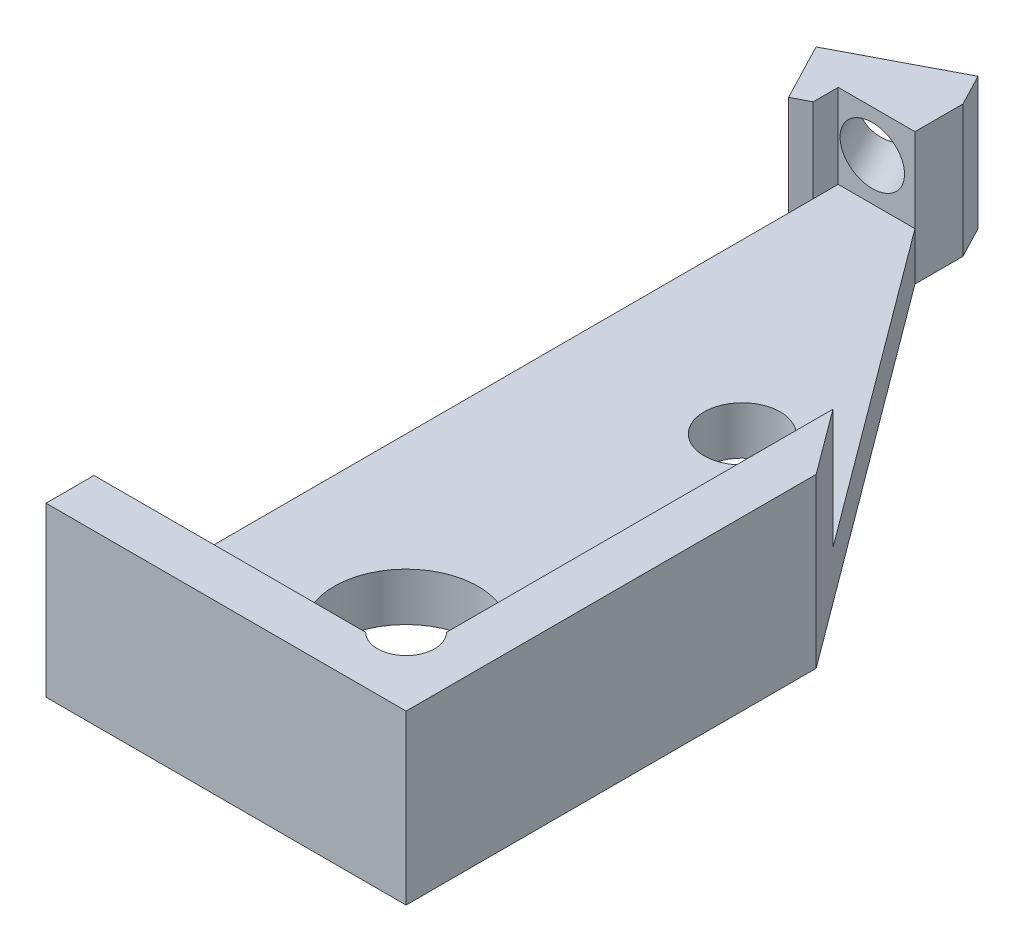
ISO-10303-21;
HEADER;
FILE_DESCRIPTION(('STEP AP214'),'2;1');
FILE_NAME('part.step','',(''),(''),'','','');
FILE_SCHEMA(('AUTOMOTIVE_DESIGN { 1 0 10303 214 1 1 1 1 }'));
ENDSEC;
DATA;
#1=APPLICATION_CONTEXT('core data for automotive mechanical design processes');
#2=APPLICATION_PROTOCOL_DEFINITION('international standard','automotive_design',2000,#1);
#3=PRODUCT_CONTEXT('',#1,'mechanical');
#4=PRODUCT('Part','Part','',(#3));
#5=PRODUCT_RELATED_PRODUCT_CATEGORY('part','',(#4));
#6=PRODUCT_DEFINITION_FORMATION('','',#4);
#7=PRODUCT_DEFINITION_CONTEXT('part definition',#1,'design');
#8=PRODUCT_DEFINITION('design','',#6,#7);
#9=PRODUCT_DEFINITION_SHAPE('','',#8);
#10=(LENGTH_UNIT() NAMED_UNIT(*) SI_UNIT(.MILLI.,.METRE.));
#11=(NAMED_UNIT(*) PLANE_ANGLE_UNIT() SI_UNIT($,.RADIAN.));
#12=(NAMED_UNIT(*) SI_UNIT($,.STERADIAN.) SOLID_ANGLE_UNIT());
#13=UNCERTAINTY_MEASURE_WITH_UNIT(LENGTH_MEASURE(1.E-05),#10,'distance_accuracy_value','');
#14=(GEOMETRIC_REPRESENTATION_CONTEXT(3) GLOBAL_UNCERTAINTY_ASSIGNED_CONTEXT((#13)) GLOBAL_UNIT_ASSIGNED_CONTEXT((#10,
#11,#12)) REPRESENTATION_CONTEXT('',''));
#15=CARTESIAN_POINT('',(0.,0.,0.));
#16=DIRECTION('',(0.,0.,1.));
#17=DIRECTION('',(1.,0.,0.));
#18=AXIS2_PLACEMENT_3D('',#15,#16,#17);
#19=CARTESIAN_POINT('',(0.,3.5,0.));
#20=DIRECTION('',(0.,-1.,0.));
#21=DIRECTION('',(0.,0.,-1.));
#22=AXIS2_PLACEMENT_3D('',#19,#20,#21);
#23=PLANE('',#22);
#24=DIRECTION('',(1.,0.,0.));
#25=VECTOR('',#24,1.);
#26=CARTESIAN_POINT('',(2.75,3.5,7.75));
#27=LINE('',#26,#25);
#28=CARTESIAN_POINT('',(-3.75,3.5,7.75));
#29=VERTEX_POINT('',#28);
#30=CARTESIAN_POINT('',(1.90810098864976,3.5,7.75));
#31=VERTEX_POINT('',#30);
#32=EDGE_CURVE('E256',#29,#31,#27,.T.);
#33=ORIENTED_EDGE('',*,*,#32,.F.);
#34=DIRECTION('',(0.,0.,1.));
#35=VECTOR('',#34,1.);
#36=CARTESIAN_POINT('',(-3.75,3.5,-8.75));
#37=LINE('',#36,#35);
#38=CARTESIAN_POINT('',(-3.75,3.5,8.75));
#39=VERTEX_POINT('',#38);
#40=EDGE_CURVE('E268',#29,#39,#37,.T.);
#41=ORIENTED_EDGE('',*,*,#40,.T.);
#42=DIRECTION('',(1.,0.,0.));
#43=VECTOR('',#42,1.);
#44=CARTESIAN_POINT('',(3.75,3.5,8.75));
#45=LINE('',#44,#43);
#46=CARTESIAN_POINT('',(3.75,3.5,8.75));
#47=VERTEX_POINT('',#46);
#48=EDGE_CURVE('E270',#39,#47,#45,.T.);
#49=ORIENTED_EDGE('',*,*,#48,.T.);
#50=DIRECTION('',(0.,0.,-1.));
#51=VECTOR('',#50,1.);
#52=CARTESIAN_POINT('',(3.75,3.5,-8.75));
#53=LINE('',#52,#51);
#54=CARTESIAN_POINT('',(3.75,3.5,0.208562074203243));
#55=VERTEX_POINT('',#54);
#56=EDGE_CURVE('E273',#47,#55,#53,.T.);
#57=ORIENTED_EDGE('',*,*,#56,.T.);
#58=DIRECTION('',(0.595668713356042,0.,0.803230218510707));
#59=VECTOR('',#58,1.);
#60=CARTESIAN_POINT('',(2.31963201516526,3.5,-1.72021941666348));
#61=LINE('',#60,#59);
#62=CARTESIAN_POINT('',(2.75,3.5,-1.13988917143168));
#63=VERTEX_POINT('',#62);
#64=EDGE_CURVE('E190',#63,#55,#61,.T.);
#65=ORIENTED_EDGE('',*,*,#64,.F.);
#66=DIRECTION('',(0.,0.,-1.));
#67=VECTOR('',#66,1.);
#68=CARTESIAN_POINT('',(2.75,3.5,-7.75));
#69=LINE('',#68,#67);
#70=CARTESIAN_POINT('',(2.75,3.5,6.90810098864977));
#71=VERTEX_POINT('',#70);
#72=EDGE_CURVE('E259',#71,#63,#69,.T.);
#73=ORIENTED_EDGE('',*,*,#72,.F.);
#74=CARTESIAN_POINT('',(2.32905049432488,3.5,7.32905049432488));
#75=DIRECTION('',(0.,1.,0.));
#76=DIRECTION('',(0.,0.,1.));
#77=AXIS2_PLACEMENT_3D('',#74,#75,#76);
#78=CIRCLE('',#77,0.595312500000001);
#79=EDGE_CURVE('E58',#31,#71,#78,.T.);
#80=ORIENTED_EDGE('',*,*,#79,.F.);
#81=EDGE_LOOP('',(#33,#41,#49,#57,#65,#73,#80));
#82=FACE_BOUND('',#81,.T.);
#83=ADVANCED_FACE('F35',(#82),#23,.F.);
#84=CARTESIAN_POINT('',(0.,2.75,0.));
#85=DIRECTION('',(0.,-1.,0.));
#86=DIRECTION('',(0.,0.,-1.));
#87=AXIS2_PLACEMENT_3D('',#84,#85,#86);
#88=PLANE('',#87);
#89=DIRECTION('',(0.,0.,1.));
#90=VECTOR('',#89,1.);
#91=CARTESIAN_POINT('',(-3.75,2.75,0.));
#92=LINE('',#91,#90);
#93=CARTESIAN_POINT('',(-3.75,2.75,-7.75));
#94=VERTEX_POINT('',#93);
#95=CARTESIAN_POINT('',(-3.75,2.75,-7.22820528636593));
#96=VERTEX_POINT('',#95);
#97=EDGE_CURVE('E164',#94,#96,#92,.T.);
#98=ORIENTED_EDGE('',*,*,#97,.F.);
#99=DIRECTION('',(-1.,0.,0.));
#100=VECTOR('',#99,1.);
#101=CARTESIAN_POINT('',(2.75,2.75,-7.75));
#102=LINE('',#101,#100);
#103=CARTESIAN_POINT('',(-2.15200209311677,2.75,-7.75));
#104=VERTEX_POINT('',#103);
#105=EDGE_CURVE('E161',#104,#94,#102,.T.);
#106=ORIENTED_EDGE('',*,*,#105,.F.);
#107=DIRECTION('',(0.,0.,1.));
#108=VECTOR('',#107,1.);
#109=CARTESIAN_POINT('',(-2.15200209311678,2.75,0.));
#110=LINE('',#109,#108);
#111=CARTESIAN_POINT('',(-2.15200209311677,2.75,-8.75));
#112=VERTEX_POINT('',#111);
#113=EDGE_CURVE('E12',#112,#104,#110,.T.);
#114=ORIENTED_EDGE('',*,*,#113,.F.);
#115=DIRECTION('',(-0.462604740450131,0.,-0.886564636173284));
#116=VECTOR('',#115,1.);
#117=CARTESIAN_POINT('',(-2.49397867231052,2.75,-9.40538528900002));
#118=LINE('',#117,#116);
#119=CARTESIAN_POINT('',(-2.49397867231052,2.75,-9.40538528900002));
#120=VERTEX_POINT('',#119);
#121=EDGE_CURVE('E202',#112,#120,#118,.T.);
#122=ORIENTED_EDGE('',*,*,#121,.T.);
#123=DIRECTION('',(-0.886564636173283,0.,0.462604740450132));
#124=VECTOR('',#123,1.);
#125=CARTESIAN_POINT('',(-2.49397867231052,2.75,-9.40538528900002));
#126=LINE('',#125,#124);
#127=CARTESIAN_POINT('',(-4.71039026274373,2.75,-8.24887343787469));
#128=VERTEX_POINT('',#127);
#129=EDGE_CURVE('E50',#120,#128,#126,.T.);
#130=ORIENTED_EDGE('',*,*,#129,.T.);
#131=DIRECTION('',(0.462604740450133,0.,0.886564636173283));
#132=VECTOR('',#131,1.);
#133=CARTESIAN_POINT('',(-4.08625811344759,2.75,-7.05274758035242));
#134=LINE('',#133,#132);
#135=CARTESIAN_POINT('',(-4.08625811344759,2.75,-7.05274758035242));
#136=VERTEX_POINT('',#135);
#137=EDGE_CURVE('E43',#128,#136,#134,.T.);
#138=ORIENTED_EDGE('',*,*,#137,.T.);
#139=DIRECTION('',(0.886564636173283,0.,-0.462604740450133));
#140=VECTOR('',#139,1.);
#141=CARTESIAN_POINT('',(-1.86984652301438,2.75,-8.20925943147775));
#142=LINE('',#141,#140);
#143=EDGE_CURVE('E198',#136,#96,#142,.T.);
#144=ORIENTED_EDGE('',*,*,#143,.T.);
#145=EDGE_LOOP('',(#98,#106,#114,#122,#130,#138,#144));
#146=FACE_BOUND('',#145,.T.);
#147=ADVANCED_FACE('F289',(#146),#88,.F.);
#148=CARTESIAN_POINT('',(-3.75,3.5,-8.75));
#149=DIRECTION('',(1.,0.,0.));
#150=DIRECTION('',(0.,0.,-1.));
#151=AXIS2_PLACEMENT_3D('',#148,#149,#150);
#152=PLANE('',#151);
#153=DIRECTION('',(0.,-1.,0.));
#154=VECTOR('',#153,1.);
#155=CARTESIAN_POINT('',(-3.75,4.,7.75));
#156=LINE('',#155,#154);
#157=CARTESIAN_POINT('',(-3.75,1.,7.75));
#158=VERTEX_POINT('',#157);
#159=EDGE_CURVE('E165',#29,#158,#156,.T.);
#160=ORIENTED_EDGE('',*,*,#159,.T.);
#161=DIRECTION('',(0.,0.,1.));
#162=VECTOR('',#161,1.);
#163=CARTESIAN_POINT('',(-3.75,1.,7.75));
#164=LINE('',#163,#162);
#165=CARTESIAN_POINT('',(-3.75,1.,-7.22820528636593));
#166=VERTEX_POINT('',#165);
#167=EDGE_CURVE('E170',#166,#158,#164,.T.);
#168=ORIENTED_EDGE('',*,*,#167,.F.);
#169=DIRECTION('',(0.,-1.,0.));
#170=VECTOR('',#169,1.);
#171=CARTESIAN_POINT('',(-3.75,3.5,-7.22820528636593));
#172=LINE('',#171,#170);
#173=CARTESIAN_POINT('',(-3.75,0.,-7.22820528636593));
#174=VERTEX_POINT('',#173);
#175=EDGE_CURVE('E224',#166,#174,#172,.T.);
#176=ORIENTED_EDGE('',*,*,#175,.T.);
#177=DIRECTION('',(0.,0.,1.));
#178=VECTOR('',#177,1.);
#179=CARTESIAN_POINT('',(-3.75,0.,-8.75));
#180=LINE('',#179,#178);
#181=CARTESIAN_POINT('',(-3.75,0.,8.75));
#182=VERTEX_POINT('',#181);
#183=EDGE_CURVE('E154',#174,#182,#180,.T.);
#184=ORIENTED_EDGE('',*,*,#183,.T.);
#185=DIRECTION('',(0.,-1.,0.));
#186=VECTOR('',#185,1.);
#187=CARTESIAN_POINT('',(-3.75,3.5,8.75));
#188=LINE('',#187,#186);
#189=EDGE_CURVE('E284',#39,#182,#188,.T.);
#190=ORIENTED_EDGE('',*,*,#189,.F.);
#191=ORIENTED_EDGE('',*,*,#40,.F.);
#192=EDGE_LOOP('',(#160,#168,#176,#184,#190,#191));
#193=FACE_BOUND('',#192,.T.);
#194=ADVANCED_FACE('F37',(#193),#152,.F.);
#195=CARTESIAN_POINT('',(-3.60218446752712,1.875,-8.82712936343735));
#196=DIRECTION('',(-0.462604740450132,0.,-0.886564636173283));
#197=DIRECTION('',(-0.886564636173283,0.,0.462604740450132));
#198=AXIS2_PLACEMENT_3D('',#195,#196,#197);
#199=CYLINDRICAL_SURFACE('',#198,0.595629999999999);
#200=CARTESIAN_POINT('',(-3.60218446752712,1.875,-8.82712936343735));
#201=DIRECTION('',(-0.462604740450132,0.,-0.886564636173283));
#202=DIRECTION('',(-0.886564636173283,0.,0.462604740450132));
#203=AXIS2_PLACEMENT_3D('',#200,#201,#202);
#204=CIRCLE('',#203,0.595629999999999);
#205=CARTESIAN_POINT('',(-4.13024896177101,1.875,-8.55158810188304));
#206=VERTEX_POINT('',#205);
#207=EDGE_CURVE('E192',#206,#206,#204,.T.);
#208=ORIENTED_EDGE('',*,*,#207,.T.);
#209=EDGE_LOOP('',(#208));
#210=FACE_BOUND('',#209,.T.);
#211=CARTESIAN_POINT('',(-3.04014405978548,1.875,-7.75));
#212=DIRECTION('',(0.,0.,-1.));
#213=DIRECTION('',(-1.,0.,0.));
#214=AXIS2_PLACEMENT_3D('',#211,#212,#213);
#215=ELLIPSE('',#214,0.671840467910994,0.595629999999999);
#216=CARTESIAN_POINT('',(-3.71198452769648,1.875,-7.75));
#217=VERTEX_POINT('',#216);
#218=EDGE_CURVE('E195',#217,#217,#215,.T.);
#219=ORIENTED_EDGE('',*,*,#218,.F.);
#220=EDGE_LOOP('',(#219));
#221=FACE_BOUND('',#220,.T.);
#222=ADVANCED_FACE('F361',(#210,#221),#199,.F.);
#223=CARTESIAN_POINT('',(3.75,3.5,-8.75));
#224=DIRECTION('',(-1.,0.,0.));
#225=DIRECTION('',(0.,0.,1.));
#226=AXIS2_PLACEMENT_3D('',#223,#224,#225);
#227=PLANE('',#226);
#228=DIRECTION('',(0.,-1.,0.));
#229=VECTOR('',#228,1.);
#230=CARTESIAN_POINT('',(3.75,5.,0.208562074203243));
#231=LINE('',#230,#229);
#232=CARTESIAN_POINT('',(3.75,0.,0.208562074203243));
#233=VERTEX_POINT('',#232);
#234=EDGE_CURVE('E185',#55,#233,#231,.T.);
#235=ORIENTED_EDGE('',*,*,#234,.F.);
#236=ORIENTED_EDGE('',*,*,#56,.F.);
#237=DIRECTION('',(0.,-1.,0.));
#238=VECTOR('',#237,1.);
#239=CARTESIAN_POINT('',(3.75,3.5,8.75));
#240=LINE('',#239,#238);
#241=CARTESIAN_POINT('',(3.75,0.,8.75));
#242=VERTEX_POINT('',#241);
#243=EDGE_CURVE('E276',#47,#242,#240,.T.);
#244=ORIENTED_EDGE('',*,*,#243,.T.);
#245=DIRECTION('',(0.,0.,-1.));
#246=VECTOR('',#245,1.);
#247=CARTESIAN_POINT('',(3.75,0.,-8.75));
#248=LINE('',#247,#246);
#249=EDGE_CURVE('E271',#242,#233,#248,.T.);
#250=ORIENTED_EDGE('',*,*,#249,.T.);
#251=EDGE_LOOP('',(#235,#236,#244,#250));
#252=FACE_BOUND('',#251,.T.);
#253=ADVANCED_FACE('F358',(#252),#227,.F.);
#254=CARTESIAN_POINT('',(0.,0.,0.));
#255=DIRECTION('',(0.,-1.,0.));
#256=DIRECTION('',(0.,0.,-1.));
#257=AXIS2_PLACEMENT_3D('',#254,#255,#256);
#258=PLANE('',#257);
#259=CARTESIAN_POINT('',(1.625,0.,6.5));
#260=DIRECTION('',(0.,1.,0.));
#261=DIRECTION('',(0.,0.,1.));
#262=AXIS2_PLACEMENT_3D('',#259,#260,#261);
#263=CIRCLE('',#262,0.79375);
#264=CARTESIAN_POINT('',(1.625,0.,7.29375));
#265=VERTEX_POINT('',#264);
#266=EDGE_CURVE('E229',#265,#265,#263,.T.);
#267=ORIENTED_EDGE('',*,*,#266,.T.);
#268=EDGE_LOOP('',(#267));
#269=FACE_BOUND('',#268,.T.);
#270=CARTESIAN_POINT('',(-2.125,0.,6.5));
#271=DIRECTION('',(0.,1.,0.));
#272=DIRECTION('',(0.,0.,1.));
#273=AXIS2_PLACEMENT_3D('',#270,#271,#272);
#274=CIRCLE('',#273,0.793750000000001);
#275=CARTESIAN_POINT('',(-2.125,0.,7.29375));
#276=VERTEX_POINT('',#275);
#277=EDGE_CURVE('E235',#276,#276,#274,.T.);
#278=ORIENTED_EDGE('',*,*,#277,.T.);
#279=EDGE_LOOP('',(#278));
#280=FACE_BOUND('',#279,.T.);
#281=CARTESIAN_POINT('',(-0.250000000000001,0.,-2.25));
#282=DIRECTION('',(0.,1.,0.));
#283=DIRECTION('',(0.,0.,1.));
#284=AXIS2_PLACEMENT_3D('',#281,#282,#283);
#285=CIRCLE('',#284,0.79375);
#286=CARTESIAN_POINT('',(-0.250000000000001,0.,-1.45625));
#287=VERTEX_POINT('',#286);
#288=EDGE_CURVE('E241',#287,#287,#285,.T.);
#289=ORIENTED_EDGE('',*,*,#288,.T.);
#290=EDGE_LOOP('',(#289));
#291=FACE_BOUND('',#290,.T.);
#292=CARTESIAN_POINT('',(-0.25,0.,4.75));
#293=DIRECTION('',(0.,1.,0.));
#294=DIRECTION('',(0.,0.,1.));
#295=AXIS2_PLACEMENT_3D('',#292,#293,#294);
#296=CIRCLE('',#295,1.5);
#297=CARTESIAN_POINT('',(-0.25,0.,6.25));
#298=VERTEX_POINT('',#297);
#299=EDGE_CURVE('E253',#298,#298,#296,.T.);
#300=ORIENTED_EDGE('',*,*,#299,.T.);
#301=EDGE_LOOP('',(#300));
#302=FACE_BOUND('',#301,.T.);
#303=DIRECTION('',(0.,0.,1.));
#304=VECTOR('',#303,1.);
#305=CARTESIAN_POINT('',(-2.15200209311677,0.,-9.31323554731023));
#306=LINE('',#305,#304);
#307=CARTESIAN_POINT('',(-2.15200209311677,0.,-8.75));
#308=VERTEX_POINT('',#307);
#309=CARTESIAN_POINT('',(-2.15200209311677,0.,-7.75));
#310=VERTEX_POINT('',#309);
#311=EDGE_CURVE('E179',#308,#310,#306,.T.);
#312=ORIENTED_EDGE('',*,*,#311,.T.);
#313=DIRECTION('',(0.595668713356042,0.,0.803230218510707));
#314=VECTOR('',#313,1.);
#315=CARTESIAN_POINT('',(-2.15200209311677,0.,-7.75));
#316=LINE('',#315,#314);
#317=EDGE_CURVE('E176',#310,#233,#316,.T.);
#318=ORIENTED_EDGE('',*,*,#317,.T.);
#319=ORIENTED_EDGE('',*,*,#249,.F.);
#320=DIRECTION('',(1.,0.,0.));
#321=VECTOR('',#320,1.);
#322=CARTESIAN_POINT('',(3.75,0.,8.75));
#323=LINE('',#322,#321);
#324=EDGE_CURVE('E278',#182,#242,#323,.T.);
#325=ORIENTED_EDGE('',*,*,#324,.F.);
#326=ORIENTED_EDGE('',*,*,#183,.F.);
#327=DIRECTION('',(0.886564636173283,0.,-0.462604740450133));
#328=VECTOR('',#327,1.);
#329=CARTESIAN_POINT('',(-1.86984652301438,0.,-8.20925943147775));
#330=LINE('',#329,#328);
#331=CARTESIAN_POINT('',(-4.08625811344759,0.,-7.05274758035242));
#332=VERTEX_POINT('',#331);
#333=EDGE_CURVE('E211',#332,#174,#330,.T.);
#334=ORIENTED_EDGE('',*,*,#333,.F.);
#335=DIRECTION('',(0.462604740450133,0.,0.886564636173283));
#336=VECTOR('',#335,1.);
#337=CARTESIAN_POINT('',(-4.08625811344759,0.,-7.05274758035242));
#338=LINE('',#337,#336);
#339=CARTESIAN_POINT('',(-4.71039026274373,0.,-8.24887343787469));
#340=VERTEX_POINT('',#339);
#341=EDGE_CURVE('E215',#340,#332,#338,.T.);
#342=ORIENTED_EDGE('',*,*,#341,.F.);
#343=DIRECTION('',(-0.886564636173283,0.,0.462604740450132));
#344=VECTOR('',#343,1.);
#345=CARTESIAN_POINT('',(-2.49397867231052,0.,-9.40538528900002));
#346=LINE('',#345,#344);
#347=CARTESIAN_POINT('',(-2.49397867231052,0.,-9.40538528900002));
#348=VERTEX_POINT('',#347);
#349=EDGE_CURVE('E205',#348,#340,#346,.T.);
#350=ORIENTED_EDGE('',*,*,#349,.F.);
#351=DIRECTION('',(-0.462604740450131,0.,-0.886564636173284));
#352=VECTOR('',#351,1.);
#353=CARTESIAN_POINT('',(-2.49397867231052,0.,-9.40538528900002));
#354=LINE('',#353,#352);
#355=EDGE_CURVE('E208',#308,#348,#354,.T.);
#356=ORIENTED_EDGE('',*,*,#355,.F.);
#357=EDGE_LOOP('',(#312,#318,#319,#325,#326,#334,#342,#350,#356));
#358=FACE_BOUND('',#357,.T.);
#359=ADVANCED_FACE('F300',(#269,#280,#291,#302,#358),#258,.T.);
#360=CARTESIAN_POINT('',(0.,1.,0.));
#361=DIRECTION('',(0.,-1.,0.));
#362=DIRECTION('',(0.,0.,-1.));
#363=AXIS2_PLACEMENT_3D('',#360,#361,#362);
#364=PLANE('',#363);
#365=CARTESIAN_POINT('',(-2.125,1.,6.5));
#366=DIRECTION('',(0.,1.,0.));
#367=DIRECTION('',(0.,0.,1.));
#368=AXIS2_PLACEMENT_3D('',#365,#366,#367);
#369=CIRCLE('',#368,0.793750000000001);
#370=CARTESIAN_POINT('',(-2.125,1.,7.29375));
#371=VERTEX_POINT('',#370);
#372=EDGE_CURVE('E232',#371,#371,#369,.T.);
#373=ORIENTED_EDGE('',*,*,#372,.F.);
#374=EDGE_LOOP('',(#373));
#375=FACE_BOUND('',#374,.T.);
#376=CARTESIAN_POINT('',(-0.25,1.,4.75));
#377=DIRECTION('',(0.,1.,0.));
#378=DIRECTION('',(0.,0.,1.));
#379=AXIS2_PLACEMENT_3D('',#376,#377,#378);
#380=CIRCLE('',#379,1.5);
#381=CARTESIAN_POINT('',(-0.25,1.,6.25));
#382=VERTEX_POINT('',#381);
#383=EDGE_CURVE('E252',#382,#382,#380,.T.);
#384=ORIENTED_EDGE('',*,*,#383,.F.);
#385=EDGE_LOOP('',(#384));
#386=FACE_BOUND('',#385,.T.);
#387=CARTESIAN_POINT('',(-0.250000000000001,1.,-2.25));
#388=DIRECTION('',(0.,1.,0.));
#389=DIRECTION('',(0.,0.,1.));
#390=AXIS2_PLACEMENT_3D('',#387,#388,#389);
#391=CIRCLE('',#390,0.79375);
#392=CARTESIAN_POINT('',(-0.250000000000001,1.,-1.45625));
#393=VERTEX_POINT('',#392);
#394=EDGE_CURVE('E238',#393,#393,#391,.T.);
#395=ORIENTED_EDGE('',*,*,#394,.F.);
#396=EDGE_LOOP('',(#395));
#397=FACE_BOUND('',#396,.T.);
#398=CARTESIAN_POINT('',(1.625,1.,6.5));
#399=DIRECTION('',(0.,1.,0.));
#400=DIRECTION('',(0.,0.,1.));
#401=AXIS2_PLACEMENT_3D('',#398,#399,#400);
#402=CIRCLE('',#401,0.79375);
#403=CARTESIAN_POINT('',(1.625,1.,7.29375));
#404=VERTEX_POINT('',#403);
#405=EDGE_CURVE('E228',#404,#404,#402,.T.);
#406=ORIENTED_EDGE('',*,*,#405,.F.);
#407=EDGE_LOOP('',(#406));
#408=FACE_BOUND('',#407,.T.);
#409=DIRECTION('',(0.595668713356042,0.,0.803230218510707));
#410=VECTOR('',#409,1.);
#411=CARTESIAN_POINT('',(2.31963201516526,1.,-1.72021941666348));
#412=LINE('',#411,#410);
#413=CARTESIAN_POINT('',(-2.15200209311677,0.999999999999994,-7.75));
#414=VERTEX_POINT('',#413);
#415=CARTESIAN_POINT('',(2.75,0.999999999999994,-1.13988917143168));
#416=VERTEX_POINT('',#415);
#417=EDGE_CURVE('E151',#414,#416,#412,.T.);
#418=ORIENTED_EDGE('',*,*,#417,.F.);
#419=DIRECTION('',(-1.,0.,0.));
#420=VECTOR('',#419,1.);
#421=CARTESIAN_POINT('',(2.75,1.,-7.75));
#422=LINE('',#421,#420);
#423=CARTESIAN_POINT('',(-3.75,1.,-7.75));
#424=VERTEX_POINT('',#423);
#425=EDGE_CURVE('E143',#414,#424,#422,.T.);
#426=ORIENTED_EDGE('',*,*,#425,.T.);
#427=EDGE_CURVE('E148',#424,#166,#164,.T.);
#428=ORIENTED_EDGE('',*,*,#427,.T.);
#429=ORIENTED_EDGE('',*,*,#167,.T.);
#430=DIRECTION('',(1.,0.,0.));
#431=VECTOR('',#430,1.);
#432=CARTESIAN_POINT('',(2.75,1.,7.75));
#433=LINE('',#432,#431);
#434=CARTESIAN_POINT('',(1.90810098864976,1.,7.75));
#435=VERTEX_POINT('',#434);
#436=EDGE_CURVE('E262',#158,#435,#433,.T.);
#437=ORIENTED_EDGE('',*,*,#436,.T.);
#438=CARTESIAN_POINT('',(2.32905049432488,1.,7.32905049432488));
#439=DIRECTION('',(0.,-1.,0.));
#440=DIRECTION('',(0.,0.,-1.));
#441=AXIS2_PLACEMENT_3D('',#438,#439,#440);
#442=CIRCLE('',#441,0.595312500000001);
#443=CARTESIAN_POINT('',(2.75,1.,6.90810098864977));
#444=VERTEX_POINT('',#443);
#445=EDGE_CURVE('E247',#435,#444,#442,.F.);
#446=ORIENTED_EDGE('',*,*,#445,.T.);
#447=DIRECTION('',(0.,0.,-1.));
#448=VECTOR('',#447,1.);
#449=CARTESIAN_POINT('',(2.75,1.,-7.75));
#450=LINE('',#449,#448);
#451=EDGE_CURVE('E155',#444,#416,#450,.T.);
#452=ORIENTED_EDGE('',*,*,#451,.T.);
#453=EDGE_LOOP('',(#418,#426,#428,#429,#437,#446,#452));
#454=FACE_BOUND('',#453,.T.);
#455=ADVANCED_FACE('F145',(#375,#386,#397,#408,#454),#364,.F.);
#456=CARTESIAN_POINT('',(2.75,-16.4468842033985,-7.75));
#457=DIRECTION('',(1.,0.,0.));
#458=DIRECTION('',(0.,0.,-1.));
#459=AXIS2_PLACEMENT_3D('',#456,#457,#458);
#460=PLANE('',#459);
#461=DIRECTION('',(0.,1.,0.));
#462=VECTOR('',#461,1.);
#463=CARTESIAN_POINT('',(2.75,-16.4468842033985,-1.13988917143168));
#464=LINE('',#463,#462);
#465=EDGE_CURVE('E187',#416,#63,#464,.T.);
#466=ORIENTED_EDGE('',*,*,#465,.F.);
#467=ORIENTED_EDGE('',*,*,#451,.F.);
#468=DIRECTION('',(0.,1.,0.));
#469=VECTOR('',#468,1.);
#470=CARTESIAN_POINT('',(2.75,-0.683798022700471,6.90810098864977));
#471=LINE('',#470,#469);
#472=EDGE_CURVE('E287',#444,#71,#471,.T.);
#473=ORIENTED_EDGE('',*,*,#472,.T.);
#474=ORIENTED_EDGE('',*,*,#72,.T.);
#475=EDGE_LOOP('',(#466,#467,#473,#474));
#476=FACE_BOUND('',#475,.T.);
#477=ADVANCED_FACE('F317',(#476),#460,.F.);
#478=CARTESIAN_POINT('',(2.75,-16.4468842033985,-7.75));
#479=DIRECTION('',(0.,0.,-1.));
#480=DIRECTION('',(-1.,0.,0.));
#481=AXIS2_PLACEMENT_3D('',#478,#479,#480);
#482=PLANE('',#481);
#483=ORIENTED_EDGE('',*,*,#218,.T.);
#484=EDGE_LOOP('',(#483));
#485=FACE_BOUND('',#484,.T.);
#486=DIRECTION('',(0.,-1.,0.));
#487=VECTOR('',#486,1.);
#488=CARTESIAN_POINT('',(-2.15200209311677,5.,-7.75));
#489=LINE('',#488,#487);
#490=EDGE_CURVE('E184',#104,#414,#489,.T.);
#491=ORIENTED_EDGE('',*,*,#490,.F.);
#492=ORIENTED_EDGE('',*,*,#105,.T.);
#493=DIRECTION('',(0.,-1.,0.));
#494=VECTOR('',#493,1.);
#495=CARTESIAN_POINT('',(-3.75,4.,-7.75));
#496=LINE('',#495,#494);
#497=EDGE_CURVE('E158',#94,#424,#496,.T.);
#498=ORIENTED_EDGE('',*,*,#497,.T.);
#499=ORIENTED_EDGE('',*,*,#425,.F.);
#500=EDGE_LOOP('',(#491,#492,#498,#499));
#501=FACE_BOUND('',#500,.T.);
#502=ADVANCED_FACE('F159',(#485,#501),#482,.F.);
#503=CARTESIAN_POINT('',(3.75,3.5,8.75));
#504=DIRECTION('',(0.,0.,-1.));
#505=DIRECTION('',(-1.,0.,0.));
#506=AXIS2_PLACEMENT_3D('',#503,#504,#505);
#507=PLANE('',#506);
#508=ORIENTED_EDGE('',*,*,#324,.T.);
#509=ORIENTED_EDGE('',*,*,#243,.F.);
#510=ORIENTED_EDGE('',*,*,#48,.F.);
#511=ORIENTED_EDGE('',*,*,#189,.T.);
#512=EDGE_LOOP('',(#508,#509,#510,#511));
#513=FACE_BOUND('',#512,.T.);
#514=ADVANCED_FACE('F363',(#513),#507,.F.);
#515=CARTESIAN_POINT('',(2.75,-16.4468842033985,7.75));
#516=DIRECTION('',(0.,0.,1.));
#517=DIRECTION('',(1.,0.,0.));
#518=AXIS2_PLACEMENT_3D('',#515,#516,#517);
#519=PLANE('',#518);
#520=ORIENTED_EDGE('',*,*,#32,.T.);
#521=DIRECTION('',(0.,1.,0.));
#522=VECTOR('',#521,1.);
#523=CARTESIAN_POINT('',(1.90810098864976,-0.683798022700471,7.75));
#524=LINE('',#523,#522);
#525=EDGE_CURVE('E249',#31,#435,#524,.F.);
#526=ORIENTED_EDGE('',*,*,#525,.T.);
#527=ORIENTED_EDGE('',*,*,#436,.F.);
#528=ORIENTED_EDGE('',*,*,#159,.F.);
#529=EDGE_LOOP('',(#520,#526,#527,#528));
#530=FACE_BOUND('',#529,.T.);
#531=ADVANCED_FACE('F310',(#530),#519,.F.);
#532=CARTESIAN_POINT('',(-0.25,0.,4.75));
#533=DIRECTION('',(0.,1.,0.));
#534=DIRECTION('',(0.,0.,1.));
#535=AXIS2_PLACEMENT_3D('',#532,#533,#534);
#536=CYLINDRICAL_SURFACE('',#535,1.5);
#537=ORIENTED_EDGE('',*,*,#299,.F.);
#538=EDGE_LOOP('',(#537));
#539=FACE_BOUND('',#538,.T.);
#540=ORIENTED_EDGE('',*,*,#383,.T.);
#541=EDGE_LOOP('',(#540));
#542=FACE_BOUND('',#541,.T.);
#543=ADVANCED_FACE('F370',(#539,#542),#536,.F.);
#544=CARTESIAN_POINT('',(2.32905049432488,-0.683798022700471,7.32905049432488));
#545=DIRECTION('',(0.,1.,0.));
#546=DIRECTION('',(0.,0.,1.));
#547=AXIS2_PLACEMENT_3D('',#544,#545,#546);
#548=CYLINDRICAL_SURFACE('',#547,0.595312500000001);
#549=ORIENTED_EDGE('',*,*,#79,.T.);
#550=ORIENTED_EDGE('',*,*,#472,.F.);
#551=ORIENTED_EDGE('',*,*,#445,.F.);
#552=ORIENTED_EDGE('',*,*,#525,.F.);
#553=EDGE_LOOP('',(#549,#550,#551,#552));
#554=FACE_BOUND('',#553,.T.);
#555=ADVANCED_FACE('F311',(#554),#548,.F.);
#556=CARTESIAN_POINT('',(-0.250000000000001,0.,-2.25));
#557=DIRECTION('',(0.,1.,0.));
#558=DIRECTION('',(0.,0.,1.));
#559=AXIS2_PLACEMENT_3D('',#556,#557,#558);
#560=CYLINDRICAL_SURFACE('',#559,0.79375);
#561=ORIENTED_EDGE('',*,*,#288,.F.);
#562=EDGE_LOOP('',(#561));
#563=FACE_BOUND('',#562,.T.);
#564=ORIENTED_EDGE('',*,*,#394,.T.);
#565=EDGE_LOOP('',(#564));
#566=FACE_BOUND('',#565,.T.);
#567=ADVANCED_FACE('F387',(#563,#566),#560,.F.);
#568=CARTESIAN_POINT('',(-2.125,0.,6.5));
#569=DIRECTION('',(0.,1.,0.));
#570=DIRECTION('',(0.,0.,1.));
#571=AXIS2_PLACEMENT_3D('',#568,#569,#570);
#572=CYLINDRICAL_SURFACE('',#571,0.793750000000001);
#573=ORIENTED_EDGE('',*,*,#277,.F.);
#574=EDGE_LOOP('',(#573));
#575=FACE_BOUND('',#574,.T.);
#576=ORIENTED_EDGE('',*,*,#372,.T.);
#577=EDGE_LOOP('',(#576));
#578=FACE_BOUND('',#577,.T.);
#579=ADVANCED_FACE('F342',(#575,#578),#572,.F.);
#580=CARTESIAN_POINT('',(1.625,0.,6.5));
#581=DIRECTION('',(0.,1.,0.));
#582=DIRECTION('',(0.,0.,1.));
#583=AXIS2_PLACEMENT_3D('',#580,#581,#582);
#584=CYLINDRICAL_SURFACE('',#583,0.79375);
#585=ORIENTED_EDGE('',*,*,#266,.F.);
#586=EDGE_LOOP('',(#585));
#587=FACE_BOUND('',#586,.T.);
#588=ORIENTED_EDGE('',*,*,#405,.T.);
#589=EDGE_LOOP('',(#588));
#590=FACE_BOUND('',#589,.T.);
#591=ADVANCED_FACE('F334',(#587,#590),#584,.F.);
#592=CARTESIAN_POINT('',(-2.49397867231052,-3.68830488510185,-9.40538528900002));
#593=DIRECTION('',(-0.462604740450132,0.,-0.886564636173283));
#594=DIRECTION('',(-0.886564636173283,0.,0.462604740450132));
#595=AXIS2_PLACEMENT_3D('',#592,#593,#594);
#596=PLANE('',#595);
#597=ORIENTED_EDGE('',*,*,#207,.F.);
#598=EDGE_LOOP('',(#597));
#599=FACE_BOUND('',#598,.T.);
#600=ORIENTED_EDGE('',*,*,#129,.F.);
#601=DIRECTION('',(0.,1.,0.));
#602=VECTOR('',#601,1.);
#603=CARTESIAN_POINT('',(-2.49397867231052,-3.68830488510185,-9.40538528900002));
#604=LINE('',#603,#602);
#605=EDGE_CURVE('E210',#348,#120,#604,.T.);
#606=ORIENTED_EDGE('',*,*,#605,.F.);
#607=ORIENTED_EDGE('',*,*,#349,.T.);
#608=DIRECTION('',(0.,1.,0.));
#609=VECTOR('',#608,1.);
#610=CARTESIAN_POINT('',(-4.71039026274373,-3.68830488510185,-8.24887343787469));
#611=LINE('',#610,#609);
#612=EDGE_CURVE('E207',#340,#128,#611,.T.);
#613=ORIENTED_EDGE('',*,*,#612,.T.);
#614=EDGE_LOOP('',(#600,#606,#607,#613));
#615=FACE_BOUND('',#614,.T.);
#616=ADVANCED_FACE('F332',(#599,#615),#596,.T.);
#617=CARTESIAN_POINT('',(-2.49397867231052,-3.68830488510185,-9.40538528900002));
#618=DIRECTION('',(0.886564636173284,0.,-0.462604740450131));
#619=DIRECTION('',(-0.462604740450131,0.,-0.886564636173284));
#620=AXIS2_PLACEMENT_3D('',#617,#618,#619);
#621=PLANE('',#620);
#622=ORIENTED_EDGE('',*,*,#121,.F.);
#623=DIRECTION('',(0.,1.,0.));
#624=VECTOR('',#623,1.);
#625=CARTESIAN_POINT('',(-2.15200209311677,3.5,-8.75));
#626=LINE('',#625,#624);
#627=EDGE_CURVE('E226',#308,#112,#626,.T.);
#628=ORIENTED_EDGE('',*,*,#627,.F.);
#629=ORIENTED_EDGE('',*,*,#355,.T.);
#630=ORIENTED_EDGE('',*,*,#605,.T.);
#631=EDGE_LOOP('',(#622,#628,#629,#630));
#632=FACE_BOUND('',#631,.T.);
#633=ADVANCED_FACE('F330',(#632),#621,.T.);
#634=CARTESIAN_POINT('',(-1.86984652301438,-3.68830488510185,-8.20925943147775));
#635=DIRECTION('',(0.462604740450133,0.,0.886564636173283));
#636=DIRECTION('',(0.886564636173283,0.,-0.462604740450133));
#637=AXIS2_PLACEMENT_3D('',#634,#635,#636);
#638=PLANE('',#637);
#639=ORIENTED_EDGE('',*,*,#143,.F.);
#640=DIRECTION('',(0.,1.,0.));
#641=VECTOR('',#640,1.);
#642=CARTESIAN_POINT('',(-4.08625811344759,-3.68830488510185,-7.05274758035242));
#643=LINE('',#642,#641);
#644=EDGE_CURVE('E214',#332,#136,#643,.T.);
#645=ORIENTED_EDGE('',*,*,#644,.F.);
#646=ORIENTED_EDGE('',*,*,#333,.T.);
#647=ORIENTED_EDGE('',*,*,#175,.F.);
#648=EDGE_CURVE('E169',#96,#166,#172,.T.);
#649=ORIENTED_EDGE('',*,*,#648,.F.);
#650=EDGE_LOOP('',(#639,#645,#646,#647,#649));
#651=FACE_BOUND('',#650,.T.);
#652=ADVANCED_FACE('F294',(#651),#638,.T.);
#653=CARTESIAN_POINT('',(-4.08625811344759,-3.68830488510185,-7.05274758035242));
#654=DIRECTION('',(-0.886564636173283,0.,0.462604740450133));
#655=DIRECTION('',(0.462604740450133,0.,0.886564636173283));
#656=AXIS2_PLACEMENT_3D('',#653,#654,#655);
#657=PLANE('',#656);
#658=ORIENTED_EDGE('',*,*,#137,.F.);
#659=ORIENTED_EDGE('',*,*,#612,.F.);
#660=ORIENTED_EDGE('',*,*,#341,.T.);
#661=ORIENTED_EDGE('',*,*,#644,.T.);
#662=EDGE_LOOP('',(#658,#659,#660,#661));
#663=FACE_BOUND('',#662,.T.);
#664=ADVANCED_FACE('F296',(#663),#657,.T.);
#665=CARTESIAN_POINT('',(-2.15200209311677,5.,-7.75));
#666=DIRECTION('',(0.803230218510707,0.,-0.595668713356042));
#667=DIRECTION('',(-0.595668713356042,0.,-0.803230218510707));
#668=AXIS2_PLACEMENT_3D('',#665,#666,#667);
#669=PLANE('',#668);
#670=ORIENTED_EDGE('',*,*,#64,.T.);
#671=ORIENTED_EDGE('',*,*,#234,.T.);
#672=ORIENTED_EDGE('',*,*,#317,.F.);
#673=EDGE_CURVE('E182',#414,#310,#489,.T.);
#674=ORIENTED_EDGE('',*,*,#673,.F.);
#675=ORIENTED_EDGE('',*,*,#417,.T.);
#676=ORIENTED_EDGE('',*,*,#465,.T.);
#677=EDGE_LOOP('',(#670,#671,#672,#674,#675,#676));
#678=FACE_BOUND('',#677,.T.);
#679=ADVANCED_FACE('F320',(#678),#669,.T.);
#680=CARTESIAN_POINT('',(-2.15200209311677,5.,-9.31323554731023));
#681=DIRECTION('',(1.,0.,0.));
#682=DIRECTION('',(0.,0.,-1.));
#683=AXIS2_PLACEMENT_3D('',#680,#681,#682);
#684=PLANE('',#683);
#685=ORIENTED_EDGE('',*,*,#113,.T.);
#686=ORIENTED_EDGE('',*,*,#490,.T.);
#687=ORIENTED_EDGE('',*,*,#673,.T.);
#688=ORIENTED_EDGE('',*,*,#311,.F.);
#689=ORIENTED_EDGE('',*,*,#627,.T.);
#690=EDGE_LOOP('',(#685,#686,#687,#688,#689));
#691=FACE_BOUND('',#690,.T.);
#692=ADVANCED_FACE('F325',(#691),#684,.T.);
#693=CARTESIAN_POINT('',(-3.75,4.,7.75));
#694=DIRECTION('',(1.,0.,0.));
#695=DIRECTION('',(0.,0.,-1.));
#696=AXIS2_PLACEMENT_3D('',#693,#694,#695);
#697=PLANE('',#696);
#698=ORIENTED_EDGE('',*,*,#427,.F.);
#699=ORIENTED_EDGE('',*,*,#497,.F.);
#700=ORIENTED_EDGE('',*,*,#97,.T.);
#701=ORIENTED_EDGE('',*,*,#648,.T.);
#702=EDGE_LOOP('',(#698,#699,#700,#701));
#703=FACE_BOUND('',#702,.T.);
#704=ADVANCED_FACE('F167',(#703),#697,.T.);
#705=CLOSED_SHELL('',(#83,#147,#194,#222,#253,#359,#455,#477,#502,#514,#531,#543,#555,#567,#579,
#591,#616,#633,#652,#664,#679,#692,#704));
#706=MANIFOLD_SOLID_BREP('B2',#705);
#707=ADVANCED_BREP_SHAPE_REPRESENTATION('',(#18,#706),#14);
#708=SHAPE_DEFINITION_REPRESENTATION(#9,#707);
ENDSEC;
END-ISO-10303-21;
